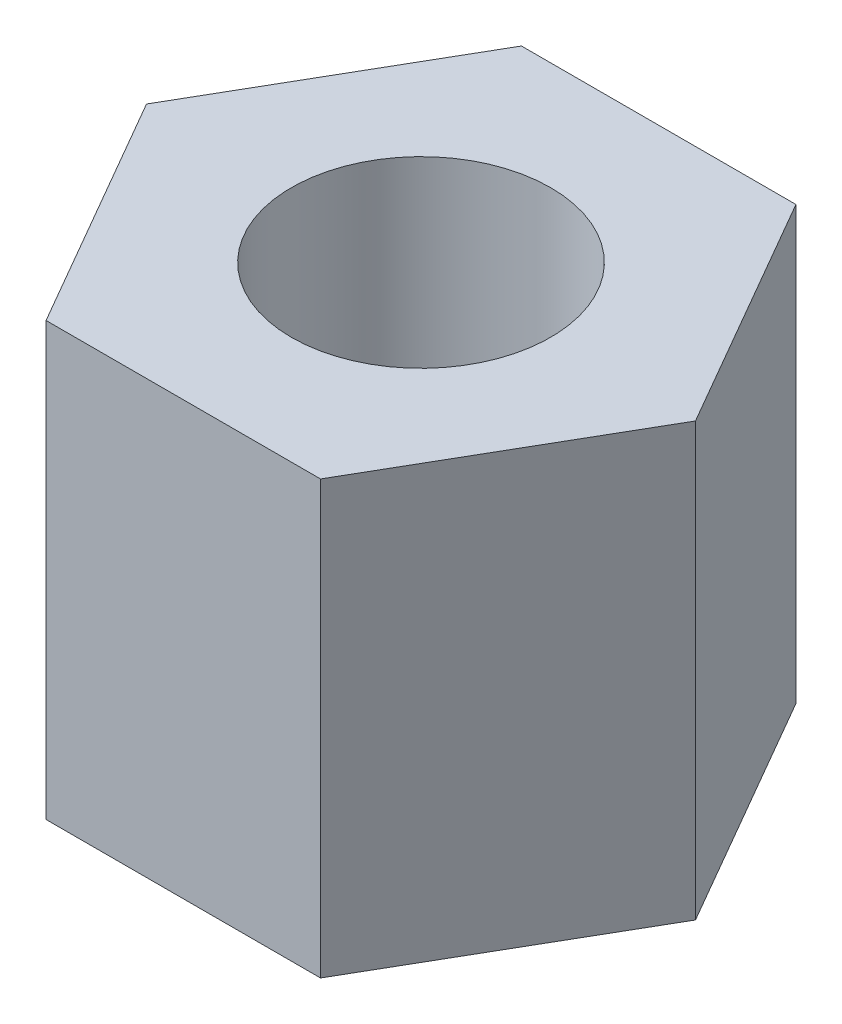
ISO-10303-21;
HEADER;
FILE_DESCRIPTION(('STEP AP214'),'2;1');
FILE_NAME('part.step','',(''),(''),'','','');
FILE_SCHEMA(('AUTOMOTIVE_DESIGN { 1 0 10303 214 1 1 1 1 }'));
ENDSEC;
DATA;
#1=APPLICATION_CONTEXT('core data for automotive mechanical design processes');
#2=APPLICATION_PROTOCOL_DEFINITION('international standard','automotive_design',2000,#1);
#3=PRODUCT_CONTEXT('',#1,'mechanical');
#4=PRODUCT('Part','Part','',(#3));
#5=PRODUCT_RELATED_PRODUCT_CATEGORY('part','',(#4));
#6=PRODUCT_DEFINITION_FORMATION('','',#4);
#7=PRODUCT_DEFINITION_CONTEXT('part definition',#1,'design');
#8=PRODUCT_DEFINITION('design','',#6,#7);
#9=PRODUCT_DEFINITION_SHAPE('','',#8);
#10=(LENGTH_UNIT() NAMED_UNIT(*) SI_UNIT(.MILLI.,.METRE.));
#11=(NAMED_UNIT(*) PLANE_ANGLE_UNIT() SI_UNIT($,.RADIAN.));
#12=(NAMED_UNIT(*) SI_UNIT($,.STERADIAN.) SOLID_ANGLE_UNIT());
#13=UNCERTAINTY_MEASURE_WITH_UNIT(LENGTH_MEASURE(1.E-05),#10,'distance_accuracy_value','');
#14=(GEOMETRIC_REPRESENTATION_CONTEXT(3) GLOBAL_UNCERTAINTY_ASSIGNED_CONTEXT((#13)) GLOBAL_UNIT_ASSIGNED_CONTEXT((#10,
#11,#12)) REPRESENTATION_CONTEXT('',''));
#15=CARTESIAN_POINT('',(0.,0.,0.));
#16=DIRECTION('',(0.,0.,1.));
#17=DIRECTION('',(1.,0.,0.));
#18=AXIS2_PLACEMENT_3D('',#15,#16,#17);
#19=CARTESIAN_POINT('',(0.,5.,0.));
#20=DIRECTION('',(0.,1.,0.));
#21=DIRECTION('',(0.,0.,1.));
#22=AXIS2_PLACEMENT_3D('',#19,#20,#21);
#23=PLANE('',#22);
#24=DIRECTION('',(0.499999999999995,0.,-0.866025403784442));
#25=VECTOR('',#24,1.);
#26=CARTESIAN_POINT('',(1.58771324027149,5.,2.74999999999997));
#27=LINE('',#26,#25);
#28=CARTESIAN_POINT('',(1.58771324027149,5.,2.74999999999997));
#29=VERTEX_POINT('',#28);
#30=CARTESIAN_POINT('',(3.17542648054293,5.,0.));
#31=VERTEX_POINT('',#30);
#32=EDGE_CURVE('E137',#29,#31,#27,.T.);
#33=ORIENTED_EDGE('',*,*,#32,.T.);
#34=DIRECTION('',(-0.500000000000001,0.,-0.866025403784438));
#35=VECTOR('',#34,1.);
#36=CARTESIAN_POINT('',(3.17542648054293,5.,0.));
#37=LINE('',#36,#35);
#38=CARTESIAN_POINT('',(1.58771324027146,5.,-2.74999999999999));
#39=VERTEX_POINT('',#38);
#40=EDGE_CURVE('E95',#31,#39,#37,.T.);
#41=ORIENTED_EDGE('',*,*,#40,.T.);
#42=DIRECTION('',(-1.,0.,0.));
#43=VECTOR('',#42,1.);
#44=CARTESIAN_POINT('',(1.58771324027146,5.,-2.74999999999999));
#45=LINE('',#44,#43);
#46=CARTESIAN_POINT('',(-1.58771324027148,5.,-2.74999999999998));
#47=VERTEX_POINT('',#46);
#48=EDGE_CURVE('E108',#39,#47,#45,.T.);
#49=ORIENTED_EDGE('',*,*,#48,.T.);
#50=DIRECTION('',(-0.499999999999995,0.,0.866025403784442));
#51=VECTOR('',#50,1.);
#52=CARTESIAN_POINT('',(-1.58771324027148,5.,-2.74999999999998));
#53=LINE('',#52,#51);
#54=CARTESIAN_POINT('',(-3.17542648054293,5.,0.));
#55=VERTEX_POINT('',#54);
#56=EDGE_CURVE('E102',#47,#55,#53,.T.);
#57=ORIENTED_EDGE('',*,*,#56,.T.);
#58=DIRECTION('',(0.500000000000007,0.,0.866025403784435));
#59=VECTOR('',#58,1.);
#60=CARTESIAN_POINT('',(-3.17542648054293,5.,0.));
#61=LINE('',#60,#59);
#62=CARTESIAN_POINT('',(-1.58771324027144,5.,2.75));
#63=VERTEX_POINT('',#62);
#64=EDGE_CURVE('E106',#55,#63,#61,.T.);
#65=ORIENTED_EDGE('',*,*,#64,.T.);
#66=DIRECTION('',(1.,0.,0.));
#67=VECTOR('',#66,1.);
#68=CARTESIAN_POINT('',(-1.58771324027144,5.,2.75));
#69=LINE('',#68,#67);
#70=EDGE_CURVE('E58',#63,#29,#69,.T.);
#71=ORIENTED_EDGE('',*,*,#70,.T.);
#72=EDGE_LOOP('',(#33,#41,#49,#57,#65,#71));
#73=FACE_BOUND('',#72,.T.);
#74=CARTESIAN_POINT('',(0.,5.,0.));
#75=DIRECTION('',(0.,1.,0.));
#76=DIRECTION('',(0.,0.,1.));
#77=AXIS2_PLACEMENT_3D('',#74,#75,#76);
#78=CIRCLE('',#77,1.5);
#79=CARTESIAN_POINT('',(0.,5.,1.5));
#80=VERTEX_POINT('',#79);
#81=EDGE_CURVE('E130',#80,#80,#78,.T.);
#82=ORIENTED_EDGE('',*,*,#81,.F.);
#83=EDGE_LOOP('',(#82));
#84=FACE_BOUND('',#83,.T.);
#85=ADVANCED_FACE('F41',(#73,#84),#23,.T.);
#86=CARTESIAN_POINT('',(0.,0.,0.));
#87=DIRECTION('',(0.,1.,0.));
#88=DIRECTION('',(0.,0.,1.));
#89=AXIS2_PLACEMENT_3D('',#86,#87,#88);
#90=PLANE('',#89);
#91=DIRECTION('',(0.499999999999995,0.,-0.866025403784442));
#92=VECTOR('',#91,1.);
#93=CARTESIAN_POINT('',(1.58771324027149,0.,2.74999999999997));
#94=LINE('',#93,#92);
#95=CARTESIAN_POINT('',(1.58771324027149,0.,2.74999999999997));
#96=VERTEX_POINT('',#95);
#97=CARTESIAN_POINT('',(3.17542648054293,0.,0.));
#98=VERTEX_POINT('',#97);
#99=EDGE_CURVE('E126',#96,#98,#94,.T.);
#100=ORIENTED_EDGE('',*,*,#99,.F.);
#101=DIRECTION('',(1.,0.,0.));
#102=VECTOR('',#101,1.);
#103=CARTESIAN_POINT('',(-1.58771324027144,0.,2.75));
#104=LINE('',#103,#102);
#105=CARTESIAN_POINT('',(-1.58771324027144,0.,2.75));
#106=VERTEX_POINT('',#105);
#107=EDGE_CURVE('E87',#106,#96,#104,.T.);
#108=ORIENTED_EDGE('',*,*,#107,.F.);
#109=DIRECTION('',(0.500000000000007,0.,0.866025403784435));
#110=VECTOR('',#109,1.);
#111=CARTESIAN_POINT('',(-3.17542648054293,0.,0.));
#112=LINE('',#111,#110);
#113=CARTESIAN_POINT('',(-3.17542648054293,0.,0.));
#114=VERTEX_POINT('',#113);
#115=EDGE_CURVE('E81',#114,#106,#112,.T.);
#116=ORIENTED_EDGE('',*,*,#115,.F.);
#117=DIRECTION('',(-0.499999999999995,0.,0.866025403784442));
#118=VECTOR('',#117,1.);
#119=CARTESIAN_POINT('',(-1.58771324027148,0.,-2.74999999999998));
#120=LINE('',#119,#118);
#121=CARTESIAN_POINT('',(-1.58771324027148,0.,-2.74999999999998));
#122=VERTEX_POINT('',#121);
#123=EDGE_CURVE('E116',#122,#114,#120,.T.);
#124=ORIENTED_EDGE('',*,*,#123,.F.);
#125=DIRECTION('',(-1.,0.,0.));
#126=VECTOR('',#125,1.);
#127=CARTESIAN_POINT('',(1.58771324027146,0.,-2.74999999999999));
#128=LINE('',#127,#126);
#129=CARTESIAN_POINT('',(1.58771324027146,0.,-2.74999999999999));
#130=VERTEX_POINT('',#129);
#131=EDGE_CURVE('E132',#130,#122,#128,.T.);
#132=ORIENTED_EDGE('',*,*,#131,.F.);
#133=DIRECTION('',(-0.500000000000001,0.,-0.866025403784438));
#134=VECTOR('',#133,1.);
#135=CARTESIAN_POINT('',(3.17542648054293,0.,0.));
#136=LINE('',#135,#134);
#137=EDGE_CURVE('E129',#98,#130,#136,.T.);
#138=ORIENTED_EDGE('',*,*,#137,.F.);
#139=EDGE_LOOP('',(#100,#108,#116,#124,#132,#138));
#140=FACE_BOUND('',#139,.T.);
#141=CARTESIAN_POINT('',(0.,0.,0.));
#142=DIRECTION('',(0.,1.,0.));
#143=DIRECTION('',(0.,0.,1.));
#144=AXIS2_PLACEMENT_3D('',#141,#142,#143);
#145=CIRCLE('',#144,1.5);
#146=CARTESIAN_POINT('',(0.,0.,1.5));
#147=VERTEX_POINT('',#146);
#148=EDGE_CURVE('E230',#147,#147,#145,.T.);
#149=ORIENTED_EDGE('',*,*,#148,.T.);
#150=EDGE_LOOP('',(#149));
#151=FACE_BOUND('',#150,.T.);
#152=ADVANCED_FACE('F146',(#140,#151),#90,.F.);
#153=CARTESIAN_POINT('',(1.58771324027149,5.,2.74999999999997));
#154=DIRECTION('',(-0.866025403784442,0.,-0.499999999999995));
#155=DIRECTION('',(-0.499999999999995,0.,0.866025403784442));
#156=AXIS2_PLACEMENT_3D('',#153,#154,#155);
#157=PLANE('',#156);
#158=ORIENTED_EDGE('',*,*,#99,.T.);
#159=DIRECTION('',(0.,-1.,0.));
#160=VECTOR('',#159,1.);
#161=CARTESIAN_POINT('',(3.17542648054293,5.,0.));
#162=LINE('',#161,#160);
#163=EDGE_CURVE('E11',#31,#98,#162,.T.);
#164=ORIENTED_EDGE('',*,*,#163,.F.);
#165=ORIENTED_EDGE('',*,*,#32,.F.);
#166=DIRECTION('',(0.,-1.,0.));
#167=VECTOR('',#166,1.);
#168=CARTESIAN_POINT('',(1.58771324027149,5.,2.74999999999997));
#169=LINE('',#168,#167);
#170=EDGE_CURVE('E122',#29,#96,#169,.T.);
#171=ORIENTED_EDGE('',*,*,#170,.T.);
#172=EDGE_LOOP('',(#158,#164,#165,#171));
#173=FACE_BOUND('',#172,.T.);
#174=ADVANCED_FACE('F43',(#173),#157,.F.);
#175=CARTESIAN_POINT('',(3.17542648054293,5.,0.));
#176=DIRECTION('',(-0.866025403784438,0.,0.500000000000001));
#177=DIRECTION('',(0.500000000000001,0.,0.866025403784438));
#178=AXIS2_PLACEMENT_3D('',#175,#176,#177);
#179=PLANE('',#178);
#180=ORIENTED_EDGE('',*,*,#137,.T.);
#181=DIRECTION('',(0.,-1.,0.));
#182=VECTOR('',#181,1.);
#183=CARTESIAN_POINT('',(1.58771324027146,5.,-2.74999999999999));
#184=LINE('',#183,#182);
#185=EDGE_CURVE('E50',#39,#130,#184,.T.);
#186=ORIENTED_EDGE('',*,*,#185,.F.);
#187=ORIENTED_EDGE('',*,*,#40,.F.);
#188=ORIENTED_EDGE('',*,*,#163,.T.);
#189=EDGE_LOOP('',(#180,#186,#187,#188));
#190=FACE_BOUND('',#189,.T.);
#191=ADVANCED_FACE('F171',(#190),#179,.F.);
#192=CARTESIAN_POINT('',(1.58771324027146,5.,-2.74999999999999));
#193=DIRECTION('',(0.,0.,1.));
#194=DIRECTION('',(1.,0.,0.));
#195=AXIS2_PLACEMENT_3D('',#192,#193,#194);
#196=PLANE('',#195);
#197=ORIENTED_EDGE('',*,*,#131,.T.);
#198=DIRECTION('',(0.,-1.,0.));
#199=VECTOR('',#198,1.);
#200=CARTESIAN_POINT('',(-1.58771324027148,5.,-2.74999999999998));
#201=LINE('',#200,#199);
#202=EDGE_CURVE('E117',#47,#122,#201,.T.);
#203=ORIENTED_EDGE('',*,*,#202,.F.);
#204=ORIENTED_EDGE('',*,*,#48,.F.);
#205=ORIENTED_EDGE('',*,*,#185,.T.);
#206=EDGE_LOOP('',(#197,#203,#204,#205));
#207=FACE_BOUND('',#206,.T.);
#208=ADVANCED_FACE('F143',(#207),#196,.F.);
#209=CARTESIAN_POINT('',(-1.58771324027148,5.,-2.74999999999998));
#210=DIRECTION('',(0.866025403784442,0.,0.499999999999995));
#211=DIRECTION('',(0.499999999999995,0.,-0.866025403784442));
#212=AXIS2_PLACEMENT_3D('',#209,#210,#211);
#213=PLANE('',#212);
#214=ORIENTED_EDGE('',*,*,#123,.T.);
#215=DIRECTION('',(0.,-1.,0.));
#216=VECTOR('',#215,1.);
#217=CARTESIAN_POINT('',(-3.17542648054293,5.,0.));
#218=LINE('',#217,#216);
#219=EDGE_CURVE('E113',#55,#114,#218,.T.);
#220=ORIENTED_EDGE('',*,*,#219,.F.);
#221=ORIENTED_EDGE('',*,*,#56,.F.);
#222=ORIENTED_EDGE('',*,*,#202,.T.);
#223=EDGE_LOOP('',(#214,#220,#221,#222));
#224=FACE_BOUND('',#223,.T.);
#225=ADVANCED_FACE('F114',(#224),#213,.F.);
#226=CARTESIAN_POINT('',(-3.17542648054293,5.,0.));
#227=DIRECTION('',(0.866025403784435,0.,-0.500000000000007));
#228=DIRECTION('',(-0.500000000000007,0.,-0.866025403784435));
#229=AXIS2_PLACEMENT_3D('',#226,#227,#228);
#230=PLANE('',#229);
#231=ORIENTED_EDGE('',*,*,#115,.T.);
#232=DIRECTION('',(0.,-1.,0.));
#233=VECTOR('',#232,1.);
#234=CARTESIAN_POINT('',(-1.58771324027144,5.,2.75));
#235=LINE('',#234,#233);
#236=EDGE_CURVE('E118',#63,#106,#235,.T.);
#237=ORIENTED_EDGE('',*,*,#236,.F.);
#238=ORIENTED_EDGE('',*,*,#64,.F.);
#239=ORIENTED_EDGE('',*,*,#219,.T.);
#240=EDGE_LOOP('',(#231,#237,#238,#239));
#241=FACE_BOUND('',#240,.T.);
#242=ADVANCED_FACE('F120',(#241),#230,.F.);
#243=CARTESIAN_POINT('',(-1.58771324027144,5.,2.75));
#244=DIRECTION('',(0.,0.,-1.));
#245=DIRECTION('',(-1.,0.,0.));
#246=AXIS2_PLACEMENT_3D('',#243,#244,#245);
#247=PLANE('',#246);
#248=ORIENTED_EDGE('',*,*,#107,.T.);
#249=ORIENTED_EDGE('',*,*,#170,.F.);
#250=ORIENTED_EDGE('',*,*,#70,.F.);
#251=ORIENTED_EDGE('',*,*,#236,.T.);
#252=EDGE_LOOP('',(#248,#249,#250,#251));
#253=FACE_BOUND('',#252,.T.);
#254=ADVANCED_FACE('F151',(#253),#247,.F.);
#255=CARTESIAN_POINT('',(0.,5.,0.));
#256=DIRECTION('',(0.,-1.,0.));
#257=DIRECTION('',(0.,0.,-1.));
#258=AXIS2_PLACEMENT_3D('',#255,#256,#257);
#259=CYLINDRICAL_SURFACE('',#258,1.5);
#260=ORIENTED_EDGE('',*,*,#81,.T.);
#261=EDGE_LOOP('',(#260));
#262=FACE_BOUND('',#261,.T.);
#263=ORIENTED_EDGE('',*,*,#148,.F.);
#264=EDGE_LOOP('',(#263));
#265=FACE_BOUND('',#264,.T.);
#266=ADVANCED_FACE('F153',(#262,#265),#259,.F.);
#267=CLOSED_SHELL('',(#85,#152,#174,#191,#208,#225,#242,#254,#266));
#268=MANIFOLD_SOLID_BREP('B2',#267);
#269=ADVANCED_BREP_SHAPE_REPRESENTATION('',(#18,#268),#14);
#270=SHAPE_DEFINITION_REPRESENTATION(#9,#269);
ENDSEC;
END-ISO-10303-21;
